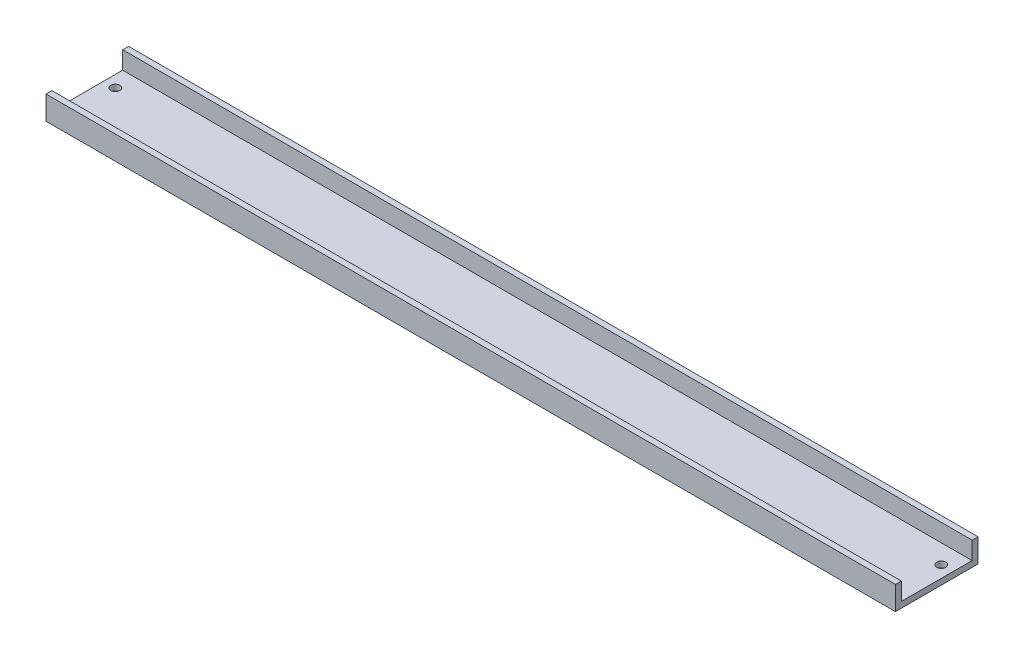
ISO-10303-21;
HEADER;
FILE_DESCRIPTION(('STEP AP214'),'2;1');
FILE_NAME('part.step','',(''),(''),'','','');
FILE_SCHEMA(('AUTOMOTIVE_DESIGN { 1 0 10303 214 1 1 1 1 }'));
ENDSEC;
DATA;
#1=APPLICATION_CONTEXT('core data for automotive mechanical design processes');
#2=APPLICATION_PROTOCOL_DEFINITION('international standard','automotive_design',2000,#1);
#3=PRODUCT_CONTEXT('',#1,'mechanical');
#4=PRODUCT('Part','Part','',(#3));
#5=PRODUCT_RELATED_PRODUCT_CATEGORY('part','',(#4));
#6=PRODUCT_DEFINITION_FORMATION('','',#4);
#7=PRODUCT_DEFINITION_CONTEXT('part definition',#1,'design');
#8=PRODUCT_DEFINITION('design','',#6,#7);
#9=PRODUCT_DEFINITION_SHAPE('','',#8);
#10=(LENGTH_UNIT() NAMED_UNIT(*) SI_UNIT(.MILLI.,.METRE.));
#11=(NAMED_UNIT(*) PLANE_ANGLE_UNIT() SI_UNIT($,.RADIAN.));
#12=(NAMED_UNIT(*) SI_UNIT($,.STERADIAN.) SOLID_ANGLE_UNIT());
#13=UNCERTAINTY_MEASURE_WITH_UNIT(LENGTH_MEASURE(1.E-05),#10,'distance_accuracy_value','');
#14=(GEOMETRIC_REPRESENTATION_CONTEXT(3) GLOBAL_UNCERTAINTY_ASSIGNED_CONTEXT((#13)) GLOBAL_UNIT_ASSIGNED_CONTEXT((#10,
#11,#12)) REPRESENTATION_CONTEXT('',''));
#15=CARTESIAN_POINT('',(0.,0.,0.));
#16=DIRECTION('',(0.,0.,1.));
#17=DIRECTION('',(1.,0.,0.));
#18=AXIS2_PLACEMENT_3D('',#15,#16,#17);
#19=CARTESIAN_POINT('',(457.2,0.,0.));
#20=DIRECTION('',(0.,1.,0.));
#21=DIRECTION('',(0.,0.,1.));
#22=AXIS2_PLACEMENT_3D('',#19,#20,#21);
#23=PLANE('',#22);
#24=CARTESIAN_POINT('',(450.83265244933,0.,-31.0166222409407));
#25=DIRECTION('',(0.,-1.,0.));
#26=DIRECTION('',(0.,0.,-1.));
#27=AXIS2_PLACEMENT_3D('',#24,#25,#26);
#28=CIRCLE('',#27,2.45744999999997);
#29=CARTESIAN_POINT('',(450.83265244933,0.,-33.4740722409407));
#30=VERTEX_POINT('',#29);
#31=EDGE_CURVE('E439',#30,#30,#28,.T.);
#32=ORIENTED_EDGE('',*,*,#31,.F.);
#33=EDGE_LOOP('',(#32));
#34=FACE_BOUND('',#33,.T.);
#35=CARTESIAN_POINT('',(6.23001745252383,0.,-5.60324835038672));
#36=DIRECTION('',(0.,-1.,0.));
#37=DIRECTION('',(0.,0.,-1.));
#38=AXIS2_PLACEMENT_3D('',#35,#36,#37);
#39=CIRCLE('',#38,2.45744999999999);
#40=CARTESIAN_POINT('',(6.23001745252383,0.,-8.06069835038671));
#41=VERTEX_POINT('',#40);
#42=EDGE_CURVE('E229',#41,#41,#39,.T.);
#43=ORIENTED_EDGE('',*,*,#42,.F.);
#44=EDGE_LOOP('',(#43));
#45=FACE_BOUND('',#44,.T.);
#46=DIRECTION('',(0.,0.,-1.));
#47=VECTOR('',#46,1.);
#48=CARTESIAN_POINT('',(0.,0.,0.));
#49=LINE('',#48,#47);
#50=CARTESIAN_POINT('',(0.,0.,0.));
#51=VERTEX_POINT('',#50);
#52=CARTESIAN_POINT('',(0.,0.,-44.45));
#53=VERTEX_POINT('',#52);
#54=EDGE_CURVE('E207',#51,#53,#49,.T.);
#55=ORIENTED_EDGE('',*,*,#54,.T.);
#56=DIRECTION('',(-1.,0.,0.));
#57=VECTOR('',#56,1.);
#58=CARTESIAN_POINT('',(457.2,0.,-44.45));
#59=LINE('',#58,#57);
#60=CARTESIAN_POINT('',(457.2,0.,-44.45));
#61=VERTEX_POINT('',#60);
#62=EDGE_CURVE('E219',#61,#53,#59,.T.);
#63=ORIENTED_EDGE('',*,*,#62,.F.);
#64=DIRECTION('',(0.,0.,-1.));
#65=VECTOR('',#64,1.);
#66=CARTESIAN_POINT('',(457.2,0.,0.));
#67=LINE('',#66,#65);
#68=CARTESIAN_POINT('',(457.2,0.,0.));
#69=VERTEX_POINT('',#68);
#70=EDGE_CURVE('E191',#69,#61,#67,.T.);
#71=ORIENTED_EDGE('',*,*,#70,.F.);
#72=DIRECTION('',(-1.,0.,0.));
#73=VECTOR('',#72,1.);
#74=CARTESIAN_POINT('',(457.2,0.,0.));
#75=LINE('',#74,#73);
#76=EDGE_CURVE('E216',#69,#51,#75,.T.);
#77=ORIENTED_EDGE('',*,*,#76,.T.);
#78=EDGE_LOOP('',(#55,#63,#71,#77));
#79=FACE_BOUND('',#78,.T.);
#80=CARTESIAN_POINT('',(6.28996677715188,0.,-31.048682801821));
#81=DIRECTION('',(0.,-1.,0.));
#82=DIRECTION('',(0.,0.,-1.));
#83=AXIS2_PLACEMENT_3D('',#80,#81,#82);
#84=CIRCLE('',#83,2.45744999999999);
#85=CARTESIAN_POINT('',(6.28996677715188,0.,-33.506132801821));
#86=VERTEX_POINT('',#85);
#87=EDGE_CURVE('E230',#86,#86,#84,.T.);
#88=ORIENTED_EDGE('',*,*,#87,.F.);
#89=EDGE_LOOP('',(#88));
#90=FACE_BOUND('',#89,.T.);
#91=CARTESIAN_POINT('',(450.814682335447,0.,-5.6087482986773));
#92=DIRECTION('',(0.,-1.,0.));
#93=DIRECTION('',(0.,0.,-1.));
#94=AXIS2_PLACEMENT_3D('',#91,#92,#93);
#95=CIRCLE('',#94,2.45744999999997);
#96=CARTESIAN_POINT('',(450.814682335447,0.,-8.06619829867727));
#97=VERTEX_POINT('',#96);
#98=EDGE_CURVE('E135',#97,#97,#95,.T.);
#99=ORIENTED_EDGE('',*,*,#98,.F.);
#100=EDGE_LOOP('',(#99));
#101=FACE_BOUND('',#100,.T.);
#102=ADVANCED_FACE('F39',(#34,#45,#79,#90,#101),#23,.F.);
#103=CARTESIAN_POINT('',(457.2,12.7,0.));
#104=DIRECTION('',(0.,1.,0.));
#105=DIRECTION('',(0.,0.,1.));
#106=AXIS2_PLACEMENT_3D('',#103,#104,#105);
#107=PLANE('',#106);
#108=DIRECTION('',(-1.,0.,0.));
#109=VECTOR('',#108,1.);
#110=CARTESIAN_POINT('',(457.2,12.7,-3.175));
#111=LINE('',#110,#109);
#112=CARTESIAN_POINT('',(457.2,12.7,-3.175));
#113=VERTEX_POINT('',#112);
#114=CARTESIAN_POINT('',(451.155166874281,12.7,-3.175));
#115=VERTEX_POINT('',#114);
#116=EDGE_CURVE('E141',#113,#115,#111,.T.);
#117=ORIENTED_EDGE('',*,*,#116,.T.);
#118=CARTESIAN_POINT('',(450.814682335447,12.7,-5.6087482986773));
#119=DIRECTION('',(0.,-1.,0.));
#120=DIRECTION('',(0.,0.,-1.));
#121=AXIS2_PLACEMENT_3D('',#118,#119,#120);
#122=CIRCLE('',#121,2.45744999999997);
#123=CARTESIAN_POINT('',(450.474197796612,12.7,-3.175));
#124=VERTEX_POINT('',#123);
#125=EDGE_CURVE('E126',#115,#124,#122,.T.);
#126=ORIENTED_EDGE('',*,*,#125,.T.);
#127=CARTESIAN_POINT('',(6.60773487513513,12.7,-3.175));
#128=VERTEX_POINT('',#127);
#129=EDGE_CURVE('E152',#124,#128,#111,.T.);
#130=ORIENTED_EDGE('',*,*,#129,.T.);
#131=CARTESIAN_POINT('',(6.23001745252383,12.7,-5.60324835038672));
#132=DIRECTION('',(0.,-1.,0.));
#133=DIRECTION('',(0.,0.,-1.));
#134=AXIS2_PLACEMENT_3D('',#131,#132,#133);
#135=CIRCLE('',#134,2.45745);
#136=CARTESIAN_POINT('',(5.85230002991253,12.7,-3.175));
#137=VERTEX_POINT('',#136);
#138=EDGE_CURVE('E236',#128,#137,#135,.T.);
#139=ORIENTED_EDGE('',*,*,#138,.T.);
#140=CARTESIAN_POINT('',(0.,12.7,-3.175));
#141=VERTEX_POINT('',#140);
#142=EDGE_CURVE('E154',#137,#141,#111,.T.);
#143=ORIENTED_EDGE('',*,*,#142,.T.);
#144=DIRECTION('',(0.,0.,-1.));
#145=VECTOR('',#144,1.);
#146=CARTESIAN_POINT('',(0.,12.7,0.));
#147=LINE('',#146,#145);
#148=CARTESIAN_POINT('',(0.,12.7,0.));
#149=VERTEX_POINT('',#148);
#150=EDGE_CURVE('E199',#149,#141,#147,.T.);
#151=ORIENTED_EDGE('',*,*,#150,.F.);
#152=DIRECTION('',(-1.,0.,0.));
#153=VECTOR('',#152,1.);
#154=CARTESIAN_POINT('',(457.2,12.7,0.));
#155=LINE('',#154,#153);
#156=CARTESIAN_POINT('',(457.2,12.7,0.));
#157=VERTEX_POINT('',#156);
#158=EDGE_CURVE('E145',#157,#149,#155,.T.);
#159=ORIENTED_EDGE('',*,*,#158,.F.);
#160=DIRECTION('',(0.,0.,-1.));
#161=VECTOR('',#160,1.);
#162=CARTESIAN_POINT('',(457.2,12.7,0.));
#163=LINE('',#162,#161);
#164=EDGE_CURVE('E149',#157,#113,#163,.T.);
#165=ORIENTED_EDGE('',*,*,#164,.T.);
#166=EDGE_LOOP('',(#117,#126,#130,#139,#143,#151,#159,#165));
#167=FACE_BOUND('',#166,.T.);
#168=ADVANCED_FACE('F41',(#167),#107,.T.);
#169=CARTESIAN_POINT('',(457.2,12.7,-3.175));
#170=DIRECTION('',(0.,0.,1.));
#171=DIRECTION('',(0.,-1.,0.));
#172=AXIS2_PLACEMENT_3D('',#169,#170,#171);
#173=PLANE('',#172);
#174=ORIENTED_EDGE('',*,*,#129,.F.);
#175=DIRECTION('',(0.,-1.,0.));
#176=VECTOR('',#175,1.);
#177=CARTESIAN_POINT('',(450.474197796612,0.,-3.175));
#178=LINE('',#177,#176);
#179=CARTESIAN_POINT('',(450.474197796612,3.175,-3.175));
#180=VERTEX_POINT('',#179);
#181=EDGE_CURVE('E11',#124,#180,#178,.T.);
#182=ORIENTED_EDGE('',*,*,#181,.T.);
#183=DIRECTION('',(-1.,0.,0.));
#184=VECTOR('',#183,1.);
#185=CARTESIAN_POINT('',(457.2,3.175,-3.175));
#186=LINE('',#185,#184);
#187=CARTESIAN_POINT('',(6.60773487513511,3.175,-3.175));
#188=VERTEX_POINT('',#187);
#189=EDGE_CURVE('E165',#180,#188,#186,.T.);
#190=ORIENTED_EDGE('',*,*,#189,.T.);
#191=DIRECTION('',(0.,-1.,0.));
#192=VECTOR('',#191,1.);
#193=CARTESIAN_POINT('',(6.60773487513511,0.,-3.175));
#194=LINE('',#193,#192);
#195=EDGE_CURVE('E247',#188,#128,#194,.F.);
#196=ORIENTED_EDGE('',*,*,#195,.T.);
#197=EDGE_LOOP('',(#174,#182,#190,#196));
#198=FACE_BOUND('',#197,.T.);
#199=ADVANCED_FACE('F305',(#198),#173,.F.);
#200=ORIENTED_EDGE('',*,*,#142,.F.);
#201=DIRECTION('',(0.,-1.,0.));
#202=VECTOR('',#201,1.);
#203=CARTESIAN_POINT('',(5.85230002991254,0.,-3.175));
#204=LINE('',#203,#202);
#205=CARTESIAN_POINT('',(5.85230002991254,3.175,-3.175));
#206=VERTEX_POINT('',#205);
#207=EDGE_CURVE('E62',#137,#206,#204,.T.);
#208=ORIENTED_EDGE('',*,*,#207,.T.);
#209=CARTESIAN_POINT('',(0.,3.175,-3.175));
#210=VERTEX_POINT('',#209);
#211=EDGE_CURVE('E166',#206,#210,#186,.T.);
#212=ORIENTED_EDGE('',*,*,#211,.T.);
#213=DIRECTION('',(0.,1.,0.));
#214=VECTOR('',#213,1.);
#215=CARTESIAN_POINT('',(0.,12.7,-3.175));
#216=LINE('',#215,#214);
#217=EDGE_CURVE('E262',#210,#141,#216,.T.);
#218=ORIENTED_EDGE('',*,*,#217,.T.);
#219=EDGE_LOOP('',(#200,#208,#212,#218));
#220=FACE_BOUND('',#219,.T.);
#221=ADVANCED_FACE('F273',(#220),#173,.F.);
#222=DIRECTION('',(-1.,0.,0.));
#223=VECTOR('',#222,1.);
#224=CARTESIAN_POINT('',(457.2,12.7,-41.275));
#225=LINE('',#224,#223);
#226=CARTESIAN_POINT('',(457.2,12.7,-41.275));
#227=VERTEX_POINT('',#226);
#228=CARTESIAN_POINT('',(0.,12.7,-41.275));
#229=VERTEX_POINT('',#228);
#230=EDGE_CURVE('E151',#227,#229,#225,.T.);
#231=ORIENTED_EDGE('',*,*,#230,.F.);
#232=CARTESIAN_POINT('',(457.2,12.7,-44.45));
#233=VERTEX_POINT('',#232);
#234=EDGE_CURVE('E187',#227,#233,#163,.T.);
#235=ORIENTED_EDGE('',*,*,#234,.T.);
#236=DIRECTION('',(-1.,0.,0.));
#237=VECTOR('',#236,1.);
#238=CARTESIAN_POINT('',(457.2,12.7,-44.45));
#239=LINE('',#238,#237);
#240=CARTESIAN_POINT('',(0.,12.7,-44.45));
#241=VERTEX_POINT('',#240);
#242=EDGE_CURVE('E198',#233,#241,#239,.T.);
#243=ORIENTED_EDGE('',*,*,#242,.T.);
#244=EDGE_CURVE('E157',#229,#241,#147,.T.);
#245=ORIENTED_EDGE('',*,*,#244,.F.);
#246=EDGE_LOOP('',(#231,#235,#243,#245));
#247=FACE_BOUND('',#246,.T.);
#248=ADVANCED_FACE('F296',(#247),#107,.T.);
#249=CARTESIAN_POINT('',(457.2,0.,0.));
#250=DIRECTION('',(0.,0.,1.));
#251=DIRECTION('',(1.,0.,0.));
#252=AXIS2_PLACEMENT_3D('',#249,#250,#251);
#253=PLANE('',#252);
#254=DIRECTION('',(0.,1.,0.));
#255=VECTOR('',#254,1.);
#256=CARTESIAN_POINT('',(0.,0.,0.));
#257=LINE('',#256,#255);
#258=EDGE_CURVE('E210',#51,#149,#257,.T.);
#259=ORIENTED_EDGE('',*,*,#258,.F.);
#260=ORIENTED_EDGE('',*,*,#76,.F.);
#261=DIRECTION('',(0.,1.,0.));
#262=VECTOR('',#261,1.);
#263=CARTESIAN_POINT('',(457.2,0.,0.));
#264=LINE('',#263,#262);
#265=EDGE_CURVE('E194',#69,#157,#264,.T.);
#266=ORIENTED_EDGE('',*,*,#265,.T.);
#267=ORIENTED_EDGE('',*,*,#158,.T.);
#268=EDGE_LOOP('',(#259,#260,#266,#267));
#269=FACE_BOUND('',#268,.T.);
#270=ADVANCED_FACE('F282',(#269),#253,.T.);
#271=CARTESIAN_POINT('',(457.2,0.,-44.45));
#272=DIRECTION('',(0.,0.,1.));
#273=DIRECTION('',(1.,0.,0.));
#274=AXIS2_PLACEMENT_3D('',#271,#272,#273);
#275=PLANE('',#274);
#276=DIRECTION('',(0.,1.,0.));
#277=VECTOR('',#276,1.);
#278=CARTESIAN_POINT('',(0.,0.,-44.45));
#279=LINE('',#278,#277);
#280=EDGE_CURVE('E203',#53,#241,#279,.T.);
#281=ORIENTED_EDGE('',*,*,#280,.T.);
#282=ORIENTED_EDGE('',*,*,#242,.F.);
#283=DIRECTION('',(0.,1.,0.));
#284=VECTOR('',#283,1.);
#285=CARTESIAN_POINT('',(457.2,0.,-44.45));
#286=LINE('',#285,#284);
#287=EDGE_CURVE('E186',#61,#233,#286,.T.);
#288=ORIENTED_EDGE('',*,*,#287,.F.);
#289=ORIENTED_EDGE('',*,*,#62,.T.);
#290=EDGE_LOOP('',(#281,#282,#288,#289));
#291=FACE_BOUND('',#290,.T.);
#292=ADVANCED_FACE('F291',(#291),#275,.F.);
#293=CARTESIAN_POINT('',(457.2,0.,0.));
#294=DIRECTION('',(1.,0.,0.));
#295=DIRECTION('',(0.,0.,-1.));
#296=AXIS2_PLACEMENT_3D('',#293,#294,#295);
#297=PLANE('',#296);
#298=DIRECTION('',(0.,-1.,0.));
#299=VECTOR('',#298,1.);
#300=CARTESIAN_POINT('',(457.2,12.7,-41.275));
#301=LINE('',#300,#299);
#302=CARTESIAN_POINT('',(457.2,3.175,-41.275));
#303=VERTEX_POINT('',#302);
#304=EDGE_CURVE('E258',#227,#303,#301,.T.);
#305=ORIENTED_EDGE('',*,*,#304,.T.);
#306=DIRECTION('',(0.,0.,1.));
#307=VECTOR('',#306,1.);
#308=CARTESIAN_POINT('',(457.2,3.175,-41.275));
#309=LINE('',#308,#307);
#310=CARTESIAN_POINT('',(457.2,3.175,-3.175));
#311=VERTEX_POINT('',#310);
#312=EDGE_CURVE('E181',#303,#311,#309,.T.);
#313=ORIENTED_EDGE('',*,*,#312,.T.);
#314=DIRECTION('',(0.,1.,0.));
#315=VECTOR('',#314,1.);
#316=CARTESIAN_POINT('',(457.2,12.7,-3.175));
#317=LINE('',#316,#315);
#318=EDGE_CURVE('E176',#311,#113,#317,.T.);
#319=ORIENTED_EDGE('',*,*,#318,.T.);
#320=ORIENTED_EDGE('',*,*,#164,.F.);
#321=ORIENTED_EDGE('',*,*,#265,.F.);
#322=ORIENTED_EDGE('',*,*,#70,.T.);
#323=ORIENTED_EDGE('',*,*,#287,.T.);
#324=ORIENTED_EDGE('',*,*,#234,.F.);
#325=EDGE_LOOP('',(#305,#313,#319,#320,#321,#322,#323,#324));
#326=FACE_BOUND('',#325,.T.);
#327=ADVANCED_FACE('F281',(#326),#297,.T.);
#328=CARTESIAN_POINT('',(0.,0.,0.));
#329=DIRECTION('',(1.,0.,0.));
#330=DIRECTION('',(0.,0.,-1.));
#331=AXIS2_PLACEMENT_3D('',#328,#329,#330);
#332=PLANE('',#331);
#333=DIRECTION('',(0.,0.,1.));
#334=VECTOR('',#333,1.);
#335=CARTESIAN_POINT('',(0.,3.175,-41.275));
#336=LINE('',#335,#334);
#337=CARTESIAN_POINT('',(0.,3.175,-41.275));
#338=VERTEX_POINT('',#337);
#339=EDGE_CURVE('E268',#338,#210,#336,.T.);
#340=ORIENTED_EDGE('',*,*,#339,.F.);
#341=DIRECTION('',(0.,-1.,0.));
#342=VECTOR('',#341,1.);
#343=CARTESIAN_POINT('',(0.,12.7,-41.275));
#344=LINE('',#343,#342);
#345=EDGE_CURVE('E257',#229,#338,#344,.T.);
#346=ORIENTED_EDGE('',*,*,#345,.F.);
#347=ORIENTED_EDGE('',*,*,#244,.T.);
#348=ORIENTED_EDGE('',*,*,#280,.F.);
#349=ORIENTED_EDGE('',*,*,#54,.F.);
#350=ORIENTED_EDGE('',*,*,#258,.T.);
#351=ORIENTED_EDGE('',*,*,#150,.T.);
#352=ORIENTED_EDGE('',*,*,#217,.F.);
#353=EDGE_LOOP('',(#340,#346,#347,#348,#349,#350,#351,#352));
#354=FACE_BOUND('',#353,.T.);
#355=ADVANCED_FACE('F275',(#354),#332,.F.);
#356=CARTESIAN_POINT('',(457.2,12.7,-41.275));
#357=DIRECTION('',(0.,0.,-1.));
#358=DIRECTION('',(-1.,0.,0.));
#359=AXIS2_PLACEMENT_3D('',#356,#357,#358);
#360=PLANE('',#359);
#361=ORIENTED_EDGE('',*,*,#345,.T.);
#362=DIRECTION('',(-1.,0.,0.));
#363=VECTOR('',#362,1.);
#364=CARTESIAN_POINT('',(457.2,3.175,-41.275));
#365=LINE('',#364,#363);
#366=EDGE_CURVE('E170',#303,#338,#365,.T.);
#367=ORIENTED_EDGE('',*,*,#366,.F.);
#368=ORIENTED_EDGE('',*,*,#304,.F.);
#369=ORIENTED_EDGE('',*,*,#230,.T.);
#370=EDGE_LOOP('',(#361,#367,#368,#369));
#371=FACE_BOUND('',#370,.T.);
#372=ADVANCED_FACE('F301',(#371),#360,.F.);
#373=CARTESIAN_POINT('',(451.155166874281,3.175,-3.175));
#374=VERTEX_POINT('',#373);
#375=EDGE_CURVE('E143',#311,#374,#186,.T.);
#376=ORIENTED_EDGE('',*,*,#375,.T.);
#377=DIRECTION('',(0.,-1.,0.));
#378=VECTOR('',#377,1.);
#379=CARTESIAN_POINT('',(451.155166874281,0.,-3.175));
#380=LINE('',#379,#378);
#381=EDGE_CURVE('E49',#374,#115,#380,.F.);
#382=ORIENTED_EDGE('',*,*,#381,.T.);
#383=ORIENTED_EDGE('',*,*,#116,.F.);
#384=ORIENTED_EDGE('',*,*,#318,.F.);
#385=EDGE_LOOP('',(#376,#382,#383,#384));
#386=FACE_BOUND('',#385,.T.);
#387=ADVANCED_FACE('F139',(#386),#173,.F.);
#388=CARTESIAN_POINT('',(457.2,3.175,-41.275));
#389=DIRECTION('',(0.,-1.,0.));
#390=DIRECTION('',(0.,0.,-1.));
#391=AXIS2_PLACEMENT_3D('',#388,#389,#390);
#392=PLANE('',#391);
#393=CARTESIAN_POINT('',(450.83265244933,3.175,-31.0166222409407));
#394=DIRECTION('',(0.,-1.,0.));
#395=DIRECTION('',(0.,0.,-1.));
#396=AXIS2_PLACEMENT_3D('',#393,#394,#395);
#397=CIRCLE('',#396,2.45744999999997);
#398=CARTESIAN_POINT('',(450.83265244933,3.175,-33.4740722409407));
#399=VERTEX_POINT('',#398);
#400=EDGE_CURVE('E43',#399,#399,#397,.T.);
#401=ORIENTED_EDGE('',*,*,#400,.T.);
#402=EDGE_LOOP('',(#401));
#403=FACE_BOUND('',#402,.T.);
#404=CARTESIAN_POINT('',(6.28996677715188,3.175,-31.048682801821));
#405=DIRECTION('',(0.,-1.,0.));
#406=DIRECTION('',(0.,0.,-1.));
#407=AXIS2_PLACEMENT_3D('',#404,#405,#406);
#408=CIRCLE('',#407,2.45744999999999);
#409=CARTESIAN_POINT('',(6.28996677715188,3.175,-33.506132801821));
#410=VERTEX_POINT('',#409);
#411=EDGE_CURVE('E226',#410,#410,#408,.T.);
#412=ORIENTED_EDGE('',*,*,#411,.T.);
#413=EDGE_LOOP('',(#412));
#414=FACE_BOUND('',#413,.T.);
#415=ORIENTED_EDGE('',*,*,#189,.F.);
#416=CARTESIAN_POINT('',(450.814682335447,3.175,-5.6087482986773));
#417=DIRECTION('',(0.,-1.,0.));
#418=DIRECTION('',(0.,0.,-1.));
#419=AXIS2_PLACEMENT_3D('',#416,#417,#418);
#420=CIRCLE('',#419,2.45744999999997);
#421=EDGE_CURVE('E134',#180,#374,#420,.T.);
#422=ORIENTED_EDGE('',*,*,#421,.T.);
#423=ORIENTED_EDGE('',*,*,#375,.F.);
#424=ORIENTED_EDGE('',*,*,#312,.F.);
#425=ORIENTED_EDGE('',*,*,#366,.T.);
#426=ORIENTED_EDGE('',*,*,#339,.T.);
#427=ORIENTED_EDGE('',*,*,#211,.F.);
#428=CARTESIAN_POINT('',(6.23001745252383,3.175,-5.60324835038672));
#429=DIRECTION('',(0.,-1.,0.));
#430=DIRECTION('',(0.,0.,-1.));
#431=AXIS2_PLACEMENT_3D('',#428,#429,#430);
#432=CIRCLE('',#431,2.45744999999999);
#433=EDGE_CURVE('E251',#206,#188,#432,.T.);
#434=ORIENTED_EDGE('',*,*,#433,.T.);
#435=EDGE_LOOP('',(#415,#422,#423,#424,#425,#426,#427,#434));
#436=FACE_BOUND('',#435,.T.);
#437=ADVANCED_FACE('F303',(#403,#414,#436),#392,.F.);
#438=CARTESIAN_POINT('',(6.23001745252383,0.,-5.60324835038672));
#439=DIRECTION('',(0.,-1.,0.));
#440=DIRECTION('',(0.,0.,-1.));
#441=AXIS2_PLACEMENT_3D('',#438,#439,#440);
#442=CYLINDRICAL_SURFACE('',#441,2.45744999999999);
#443=ORIENTED_EDGE('',*,*,#42,.T.);
#444=EDGE_LOOP('',(#443));
#445=FACE_BOUND('',#444,.T.);
#446=ORIENTED_EDGE('',*,*,#138,.F.);
#447=ORIENTED_EDGE('',*,*,#195,.F.);
#448=ORIENTED_EDGE('',*,*,#433,.F.);
#449=ORIENTED_EDGE('',*,*,#207,.F.);
#450=EDGE_LOOP('',(#446,#447,#448,#449));
#451=FACE_BOUND('',#450,.T.);
#452=ADVANCED_FACE('F307',(#445,#451),#442,.F.);
#453=CARTESIAN_POINT('',(6.28996677715188,0.,-31.048682801821));
#454=DIRECTION('',(0.,-1.,0.));
#455=DIRECTION('',(0.,0.,-1.));
#456=AXIS2_PLACEMENT_3D('',#453,#454,#455);
#457=CYLINDRICAL_SURFACE('',#456,2.45744999999999);
#458=ORIENTED_EDGE('',*,*,#87,.T.);
#459=EDGE_LOOP('',(#458));
#460=FACE_BOUND('',#459,.T.);
#461=ORIENTED_EDGE('',*,*,#411,.F.);
#462=EDGE_LOOP('',(#461));
#463=FACE_BOUND('',#462,.T.);
#464=ADVANCED_FACE('F309',(#460,#463),#457,.F.);
#465=CARTESIAN_POINT('',(450.814682335447,0.,-5.6087482986773));
#466=DIRECTION('',(0.,-1.,0.));
#467=DIRECTION('',(0.,0.,-1.));
#468=AXIS2_PLACEMENT_3D('',#465,#466,#467);
#469=CYLINDRICAL_SURFACE('',#468,2.45744999999997);
#470=ORIENTED_EDGE('',*,*,#98,.T.);
#471=EDGE_LOOP('',(#470));
#472=FACE_BOUND('',#471,.T.);
#473=ORIENTED_EDGE('',*,*,#125,.F.);
#474=ORIENTED_EDGE('',*,*,#381,.F.);
#475=ORIENTED_EDGE('',*,*,#421,.F.);
#476=ORIENTED_EDGE('',*,*,#181,.F.);
#477=EDGE_LOOP('',(#473,#474,#475,#476));
#478=FACE_BOUND('',#477,.T.);
#479=ADVANCED_FACE('F128',(#472,#478),#469,.F.);
#480=CARTESIAN_POINT('',(450.83265244933,0.,-31.0166222409407));
#481=DIRECTION('',(0.,-1.,0.));
#482=DIRECTION('',(0.,0.,-1.));
#483=AXIS2_PLACEMENT_3D('',#480,#481,#482);
#484=CYLINDRICAL_SURFACE('',#483,2.45744999999997);
#485=ORIENTED_EDGE('',*,*,#31,.T.);
#486=EDGE_LOOP('',(#485));
#487=FACE_BOUND('',#486,.T.);
#488=ORIENTED_EDGE('',*,*,#400,.F.);
#489=EDGE_LOOP('',(#488));
#490=FACE_BOUND('',#489,.T.);
#491=ADVANCED_FACE('F423',(#487,#490),#484,.F.);
#492=CLOSED_SHELL('',(#102,#168,#199,#221,#248,#270,#292,#327,#355,#372,#387,#437,#452,#464,
#479,#491));
#493=MANIFOLD_SOLID_BREP('B2',#492);
#494=ADVANCED_BREP_SHAPE_REPRESENTATION('',(#18,#493),#14);
#495=SHAPE_DEFINITION_REPRESENTATION(#9,#494);
ENDSEC;
END-ISO-10303-21;
